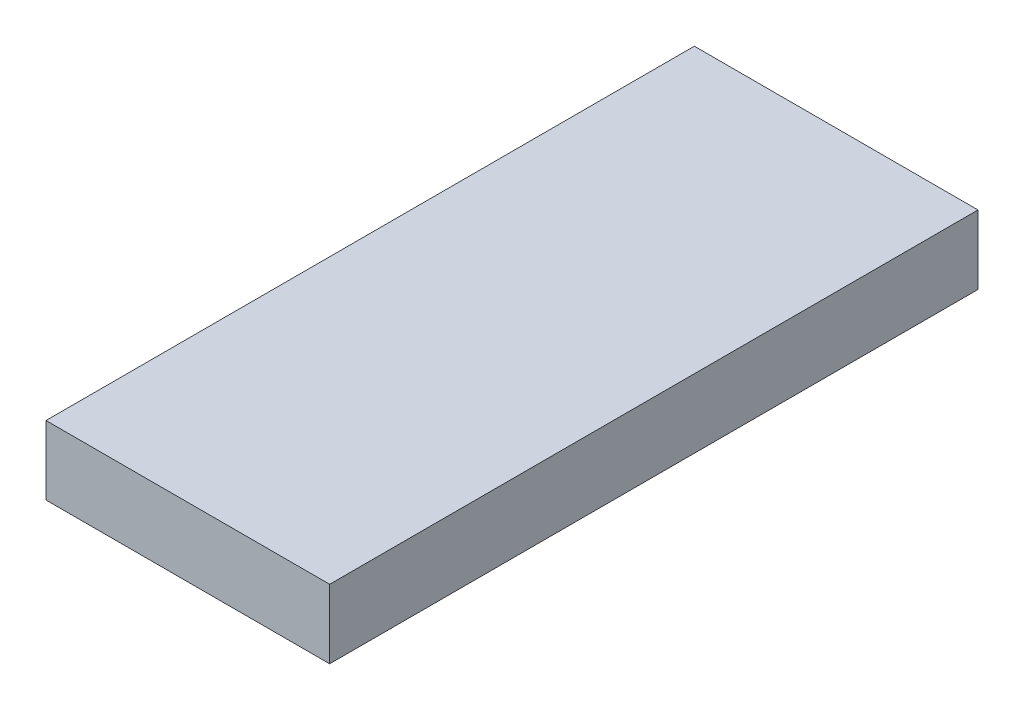
ISO-10303-21;
HEADER;
FILE_DESCRIPTION(('STEP AP214'),'2;1');
FILE_NAME('part.step','',(''),(''),'','','');
FILE_SCHEMA(('AUTOMOTIVE_DESIGN { 1 0 10303 214 1 1 1 1 }'));
ENDSEC;
DATA;
#1=APPLICATION_CONTEXT('core data for automotive mechanical design processes');
#2=APPLICATION_PROTOCOL_DEFINITION('international standard','automotive_design',2000,#1);
#3=PRODUCT_CONTEXT('',#1,'mechanical');
#4=PRODUCT('Part','Part','',(#3));
#5=PRODUCT_RELATED_PRODUCT_CATEGORY('part','',(#4));
#6=PRODUCT_DEFINITION_FORMATION('','',#4);
#7=PRODUCT_DEFINITION_CONTEXT('part definition',#1,'design');
#8=PRODUCT_DEFINITION('design','',#6,#7);
#9=PRODUCT_DEFINITION_SHAPE('','',#8);
#10=(LENGTH_UNIT() NAMED_UNIT(*) SI_UNIT(.MILLI.,.METRE.));
#11=(NAMED_UNIT(*) PLANE_ANGLE_UNIT() SI_UNIT($,.RADIAN.));
#12=(NAMED_UNIT(*) SI_UNIT($,.STERADIAN.) SOLID_ANGLE_UNIT());
#13=UNCERTAINTY_MEASURE_WITH_UNIT(LENGTH_MEASURE(1.E-05),#10,'distance_accuracy_value','');
#14=(GEOMETRIC_REPRESENTATION_CONTEXT(3) GLOBAL_UNCERTAINTY_ASSIGNED_CONTEXT((#13)) GLOBAL_UNIT_ASSIGNED_CONTEXT((#10,
#11,#12)) REPRESENTATION_CONTEXT('',''));
#15=CARTESIAN_POINT('',(0.,0.,0.));
#16=DIRECTION('',(0.,0.,1.));
#17=DIRECTION('',(1.,0.,0.));
#18=AXIS2_PLACEMENT_3D('',#15,#16,#17);
#19=CARTESIAN_POINT('',(-3.5,0.,16.));
#20=DIRECTION('',(1.,0.,0.));
#21=DIRECTION('',(0.,0.,-1.));
#22=AXIS2_PLACEMENT_3D('',#19,#20,#21);
#23=PLANE('',#22);
#24=DIRECTION('',(0.,-1.,0.));
#25=VECTOR('',#24,1.);
#26=CARTESIAN_POINT('',(-3.5,0.,0.));
#27=LINE('',#26,#25);
#28=CARTESIAN_POINT('',(-3.5,1.7,0.));
#29=VERTEX_POINT('',#28);
#30=CARTESIAN_POINT('',(-3.5,0.,0.));
#31=VERTEX_POINT('',#30);
#32=EDGE_CURVE('E97',#29,#31,#27,.T.);
#33=ORIENTED_EDGE('',*,*,#32,.T.);
#34=DIRECTION('',(0.,0.,-1.));
#35=VECTOR('',#34,1.);
#36=CARTESIAN_POINT('',(-3.5,0.,16.));
#37=LINE('',#36,#35);
#38=CARTESIAN_POINT('',(-3.5,0.,16.));
#39=VERTEX_POINT('',#38);
#40=EDGE_CURVE('E11',#39,#31,#37,.T.);
#41=ORIENTED_EDGE('',*,*,#40,.F.);
#42=DIRECTION('',(0.,-1.,0.));
#43=VECTOR('',#42,1.);
#44=CARTESIAN_POINT('',(-3.5,0.,16.));
#45=LINE('',#44,#43);
#46=CARTESIAN_POINT('',(-3.5,1.7,16.));
#47=VERTEX_POINT('',#46);
#48=EDGE_CURVE('E85',#47,#39,#45,.T.);
#49=ORIENTED_EDGE('',*,*,#48,.F.);
#50=DIRECTION('',(0.,0.,-1.));
#51=VECTOR('',#50,1.);
#52=CARTESIAN_POINT('',(-3.5,1.7,16.));
#53=LINE('',#52,#51);
#54=EDGE_CURVE('E93',#47,#29,#53,.T.);
#55=ORIENTED_EDGE('',*,*,#54,.T.);
#56=EDGE_LOOP('',(#33,#41,#49,#55));
#57=FACE_BOUND('',#56,.T.);
#58=ADVANCED_FACE('F34',(#57),#23,.F.);
#59=CARTESIAN_POINT('',(-3.5,0.,16.));
#60=DIRECTION('',(0.,1.,0.));
#61=DIRECTION('',(0.,0.,1.));
#62=AXIS2_PLACEMENT_3D('',#59,#60,#61);
#63=PLANE('',#62);
#64=DIRECTION('',(1.,0.,0.));
#65=VECTOR('',#64,1.);
#66=CARTESIAN_POINT('',(-3.5,0.,0.));
#67=LINE('',#66,#65);
#68=CARTESIAN_POINT('',(3.5,0.,0.));
#69=VERTEX_POINT('',#68);
#70=EDGE_CURVE('E89',#31,#69,#67,.T.);
#71=ORIENTED_EDGE('',*,*,#70,.T.);
#72=DIRECTION('',(0.,0.,-1.));
#73=VECTOR('',#72,1.);
#74=CARTESIAN_POINT('',(3.5,0.,16.));
#75=LINE('',#74,#73);
#76=CARTESIAN_POINT('',(3.5,0.,16.));
#77=VERTEX_POINT('',#76);
#78=EDGE_CURVE('E42',#77,#69,#75,.T.);
#79=ORIENTED_EDGE('',*,*,#78,.F.);
#80=DIRECTION('',(1.,0.,0.));
#81=VECTOR('',#80,1.);
#82=CARTESIAN_POINT('',(-3.5,0.,16.));
#83=LINE('',#82,#81);
#84=EDGE_CURVE('E80',#39,#77,#83,.T.);
#85=ORIENTED_EDGE('',*,*,#84,.F.);
#86=ORIENTED_EDGE('',*,*,#40,.T.);
#87=EDGE_LOOP('',(#71,#79,#85,#86));
#88=FACE_BOUND('',#87,.T.);
#89=ADVANCED_FACE('F88',(#88),#63,.F.);
#90=CARTESIAN_POINT('',(3.5,0.,16.));
#91=DIRECTION('',(-1.,0.,0.));
#92=DIRECTION('',(0.,-1.,0.));
#93=AXIS2_PLACEMENT_3D('',#90,#91,#92);
#94=PLANE('',#93);
#95=DIRECTION('',(0.,1.,0.));
#96=VECTOR('',#95,1.);
#97=CARTESIAN_POINT('',(3.5,0.,0.));
#98=LINE('',#97,#96);
#99=CARTESIAN_POINT('',(3.5,1.7,0.));
#100=VERTEX_POINT('',#99);
#101=EDGE_CURVE('E67',#69,#100,#98,.T.);
#102=ORIENTED_EDGE('',*,*,#101,.T.);
#103=DIRECTION('',(0.,0.,-1.));
#104=VECTOR('',#103,1.);
#105=CARTESIAN_POINT('',(3.5,1.7,16.));
#106=LINE('',#105,#104);
#107=CARTESIAN_POINT('',(3.5,1.7,16.));
#108=VERTEX_POINT('',#107);
#109=EDGE_CURVE('E90',#108,#100,#106,.T.);
#110=ORIENTED_EDGE('',*,*,#109,.F.);
#111=DIRECTION('',(0.,1.,0.));
#112=VECTOR('',#111,1.);
#113=CARTESIAN_POINT('',(3.5,0.,16.));
#114=LINE('',#113,#112);
#115=EDGE_CURVE('E83',#77,#108,#114,.T.);
#116=ORIENTED_EDGE('',*,*,#115,.F.);
#117=ORIENTED_EDGE('',*,*,#78,.T.);
#118=EDGE_LOOP('',(#102,#110,#116,#117));
#119=FACE_BOUND('',#118,.T.);
#120=ADVANCED_FACE('F91',(#119),#94,.F.);
#121=CARTESIAN_POINT('',(-3.5,1.7,16.));
#122=DIRECTION('',(0.,-1.,0.));
#123=DIRECTION('',(0.,0.,-1.));
#124=AXIS2_PLACEMENT_3D('',#121,#122,#123);
#125=PLANE('',#124);
#126=DIRECTION('',(-1.,0.,0.));
#127=VECTOR('',#126,1.);
#128=CARTESIAN_POINT('',(-3.5,1.7,0.));
#129=LINE('',#128,#127);
#130=EDGE_CURVE('E73',#100,#29,#129,.T.);
#131=ORIENTED_EDGE('',*,*,#130,.T.);
#132=ORIENTED_EDGE('',*,*,#54,.F.);
#133=DIRECTION('',(-1.,0.,0.));
#134=VECTOR('',#133,1.);
#135=CARTESIAN_POINT('',(-3.5,1.7,16.));
#136=LINE('',#135,#134);
#137=EDGE_CURVE('E50',#108,#47,#136,.T.);
#138=ORIENTED_EDGE('',*,*,#137,.F.);
#139=ORIENTED_EDGE('',*,*,#109,.T.);
#140=EDGE_LOOP('',(#131,#132,#138,#139));
#141=FACE_BOUND('',#140,.T.);
#142=ADVANCED_FACE('F104',(#141),#125,.F.);
#143=CARTESIAN_POINT('',(-3.5,1.7,16.));
#144=DIRECTION('',(0.,0.,-1.));
#145=DIRECTION('',(-1.,0.,0.));
#146=AXIS2_PLACEMENT_3D('',#143,#144,#145);
#147=PLANE('',#146);
#148=ORIENTED_EDGE('',*,*,#48,.T.);
#149=ORIENTED_EDGE('',*,*,#84,.T.);
#150=ORIENTED_EDGE('',*,*,#115,.T.);
#151=ORIENTED_EDGE('',*,*,#137,.T.);
#152=EDGE_LOOP('',(#148,#149,#150,#151));
#153=FACE_BOUND('',#152,.T.);
#154=ADVANCED_FACE('F81',(#153),#147,.F.);
#155=CARTESIAN_POINT('',(-3.5,1.7,0.));
#156=DIRECTION('',(0.,0.,-1.));
#157=DIRECTION('',(-1.,0.,0.));
#158=AXIS2_PLACEMENT_3D('',#155,#156,#157);
#159=PLANE('',#158);
#160=ORIENTED_EDGE('',*,*,#32,.F.);
#161=ORIENTED_EDGE('',*,*,#130,.F.);
#162=ORIENTED_EDGE('',*,*,#101,.F.);
#163=ORIENTED_EDGE('',*,*,#70,.F.);
#164=EDGE_LOOP('',(#160,#161,#162,#163));
#165=FACE_BOUND('',#164,.T.);
#166=ADVANCED_FACE('F107',(#165),#159,.T.);
#167=CLOSED_SHELL('',(#58,#89,#120,#142,#154,#166));
#168=MANIFOLD_SOLID_BREP('B2',#167);
#169=ADVANCED_BREP_SHAPE_REPRESENTATION('',(#18,#168),#14);
#170=SHAPE_DEFINITION_REPRESENTATION(#9,#169);
ENDSEC;
END-ISO-10303-21;
